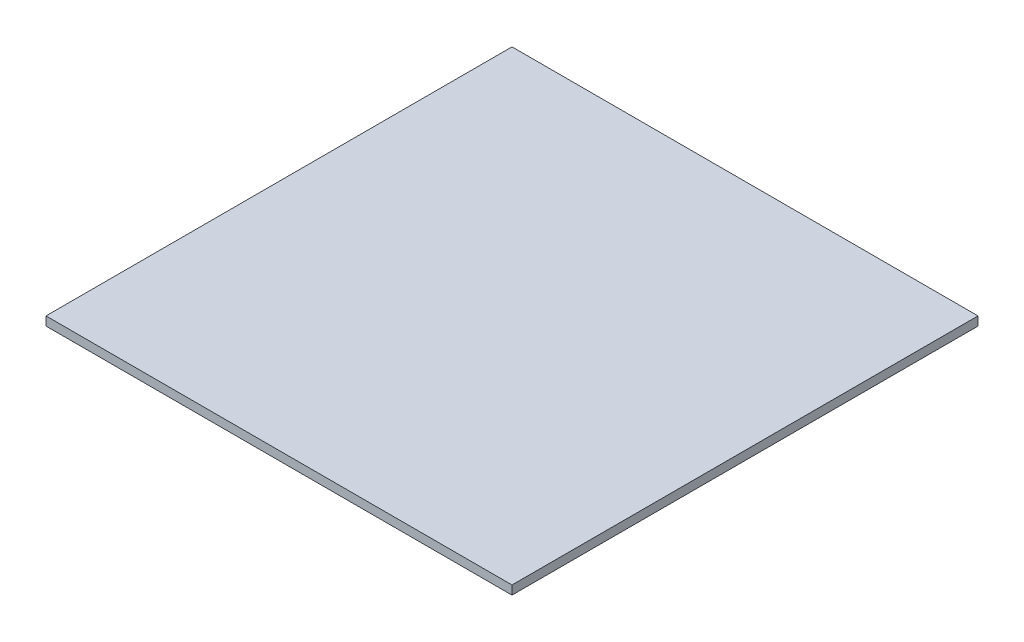
ISO-10303-21;
HEADER;
FILE_DESCRIPTION(('STEP AP214'),'2;1');
FILE_NAME('part.step','',(''),(''),'','','');
FILE_SCHEMA(('AUTOMOTIVE_DESIGN { 1 0 10303 214 1 1 1 1 }'));
ENDSEC;
DATA;
#1=APPLICATION_CONTEXT('core data for automotive mechanical design processes');
#2=APPLICATION_PROTOCOL_DEFINITION('international standard','automotive_design',2000,#1);
#3=PRODUCT_CONTEXT('',#1,'mechanical');
#4=PRODUCT('Part','Part','',(#3));
#5=PRODUCT_RELATED_PRODUCT_CATEGORY('part','',(#4));
#6=PRODUCT_DEFINITION_FORMATION('','',#4);
#7=PRODUCT_DEFINITION_CONTEXT('part definition',#1,'design');
#8=PRODUCT_DEFINITION('design','',#6,#7);
#9=PRODUCT_DEFINITION_SHAPE('','',#8);
#10=(LENGTH_UNIT() NAMED_UNIT(*) SI_UNIT(.MILLI.,.METRE.));
#11=(NAMED_UNIT(*) PLANE_ANGLE_UNIT() SI_UNIT($,.RADIAN.));
#12=(NAMED_UNIT(*) SI_UNIT($,.STERADIAN.) SOLID_ANGLE_UNIT());
#13=UNCERTAINTY_MEASURE_WITH_UNIT(LENGTH_MEASURE(1.E-05),#10,'distance_accuracy_value','');
#14=(GEOMETRIC_REPRESENTATION_CONTEXT(3) GLOBAL_UNCERTAINTY_ASSIGNED_CONTEXT((#13)) GLOBAL_UNIT_ASSIGNED_CONTEXT((#10,
#11,#12)) REPRESENTATION_CONTEXT('',''));
#15=CARTESIAN_POINT('',(0.,0.,0.));
#16=DIRECTION('',(0.,0.,1.));
#17=DIRECTION('',(1.,0.,0.));
#18=AXIS2_PLACEMENT_3D('',#15,#16,#17);
#19=CARTESIAN_POINT('',(0.,1.5875,0.));
#20=DIRECTION('',(-1.,0.,0.));
#21=DIRECTION('',(0.,0.,1.));
#22=AXIS2_PLACEMENT_3D('',#19,#20,#21);
#23=PLANE('',#22);
#24=DIRECTION('',(0.,0.,-1.));
#25=VECTOR('',#24,1.);
#26=CARTESIAN_POINT('',(0.,0.,0.));
#27=LINE('',#26,#25);
#28=CARTESIAN_POINT('',(0.,0.,0.));
#29=VERTEX_POINT('',#28);
#30=CARTESIAN_POINT('',(0.,0.,-108.585));
#31=VERTEX_POINT('',#30);
#32=EDGE_CURVE('E131',#29,#31,#27,.T.);
#33=ORIENTED_EDGE('',*,*,#32,.T.);
#34=DIRECTION('',(0.,-1.,0.));
#35=VECTOR('',#34,1.);
#36=CARTESIAN_POINT('',(0.,1.5875,-108.585));
#37=LINE('',#36,#35);
#38=CARTESIAN_POINT('',(0.,1.5875,-108.585));
#39=VERTEX_POINT('',#38);
#40=EDGE_CURVE('E11',#39,#31,#37,.T.);
#41=ORIENTED_EDGE('',*,*,#40,.F.);
#42=DIRECTION('',(0.,0.,-1.));
#43=VECTOR('',#42,1.);
#44=CARTESIAN_POINT('',(0.,1.5875,0.));
#45=LINE('',#44,#43);
#46=CARTESIAN_POINT('',(0.,1.5875,0.));
#47=VERTEX_POINT('',#46);
#48=EDGE_CURVE('E140',#47,#39,#45,.T.);
#49=ORIENTED_EDGE('',*,*,#48,.F.);
#50=DIRECTION('',(0.,-1.,0.));
#51=VECTOR('',#50,1.);
#52=CARTESIAN_POINT('',(0.,1.5875,0.));
#53=LINE('',#52,#51);
#54=EDGE_CURVE('E149',#47,#29,#53,.T.);
#55=ORIENTED_EDGE('',*,*,#54,.T.);
#56=EDGE_LOOP('',(#33,#41,#49,#55));
#57=FACE_BOUND('',#56,.T.);
#58=ADVANCED_FACE('F33',(#57),#23,.F.);
#59=CARTESIAN_POINT('',(0.,1.5875,-108.585));
#60=DIRECTION('',(0.,0.,1.));
#61=DIRECTION('',(1.,0.,0.));
#62=AXIS2_PLACEMENT_3D('',#59,#60,#61);
#63=PLANE('',#62);
#64=DIRECTION('',(-1.,0.,0.));
#65=VECTOR('',#64,1.);
#66=CARTESIAN_POINT('',(0.,0.,-108.585));
#67=LINE('',#66,#65);
#68=CARTESIAN_POINT('',(-108.585,0.,-108.585));
#69=VERTEX_POINT('',#68);
#70=EDGE_CURVE('E134',#31,#69,#67,.T.);
#71=ORIENTED_EDGE('',*,*,#70,.T.);
#72=DIRECTION('',(0.,-1.,0.));
#73=VECTOR('',#72,1.);
#74=CARTESIAN_POINT('',(-108.585,1.5875,-108.585));
#75=LINE('',#74,#73);
#76=CARTESIAN_POINT('',(-108.585,1.5875,-108.585));
#77=VERTEX_POINT('',#76);
#78=EDGE_CURVE('E41',#77,#69,#75,.T.);
#79=ORIENTED_EDGE('',*,*,#78,.F.);
#80=DIRECTION('',(-1.,0.,0.));
#81=VECTOR('',#80,1.);
#82=CARTESIAN_POINT('',(0.,1.5875,-108.585));
#83=LINE('',#82,#81);
#84=EDGE_CURVE('E75',#39,#77,#83,.T.);
#85=ORIENTED_EDGE('',*,*,#84,.F.);
#86=ORIENTED_EDGE('',*,*,#40,.T.);
#87=EDGE_LOOP('',(#71,#79,#85,#86));
#88=FACE_BOUND('',#87,.T.);
#89=ADVANCED_FACE('F175',(#88),#63,.F.);
#90=CARTESIAN_POINT('',(-108.585,1.5875,0.));
#91=DIRECTION('',(1.,0.,0.));
#92=DIRECTION('',(0.,0.,-1.));
#93=AXIS2_PLACEMENT_3D('',#90,#91,#92);
#94=PLANE('',#93);
#95=DIRECTION('',(0.,0.,1.));
#96=VECTOR('',#95,1.);
#97=CARTESIAN_POINT('',(-108.585,0.,0.));
#98=LINE('',#97,#96);
#99=CARTESIAN_POINT('',(-108.585,0.,0.));
#100=VERTEX_POINT('',#99);
#101=EDGE_CURVE('E65',#69,#100,#98,.T.);
#102=ORIENTED_EDGE('',*,*,#101,.T.);
#103=DIRECTION('',(0.,-1.,0.));
#104=VECTOR('',#103,1.);
#105=CARTESIAN_POINT('',(-108.585,1.5875,0.));
#106=LINE('',#105,#104);
#107=CARTESIAN_POINT('',(-108.585,1.5875,0.));
#108=VERTEX_POINT('',#107);
#109=EDGE_CURVE('E49',#108,#100,#106,.T.);
#110=ORIENTED_EDGE('',*,*,#109,.F.);
#111=DIRECTION('',(0.,0.,1.));
#112=VECTOR('',#111,1.);
#113=CARTESIAN_POINT('',(-108.585,1.5875,0.));
#114=LINE('',#113,#112);
#115=EDGE_CURVE('E144',#77,#108,#114,.T.);
#116=ORIENTED_EDGE('',*,*,#115,.F.);
#117=ORIENTED_EDGE('',*,*,#78,.T.);
#118=EDGE_LOOP('',(#102,#110,#116,#117));
#119=FACE_BOUND('',#118,.T.);
#120=ADVANCED_FACE('F155',(#119),#94,.F.);
#121=CARTESIAN_POINT('',(0.,1.5875,0.));
#122=DIRECTION('',(0.,0.,-1.));
#123=DIRECTION('',(-1.,0.,0.));
#124=AXIS2_PLACEMENT_3D('',#121,#122,#123);
#125=PLANE('',#124);
#126=DIRECTION('',(1.,0.,0.));
#127=VECTOR('',#126,1.);
#128=CARTESIAN_POINT('',(0.,0.,0.));
#129=LINE('',#128,#127);
#130=EDGE_CURVE('E70',#100,#29,#129,.T.);
#131=ORIENTED_EDGE('',*,*,#130,.T.);
#132=ORIENTED_EDGE('',*,*,#54,.F.);
#133=DIRECTION('',(1.,0.,0.));
#134=VECTOR('',#133,1.);
#135=CARTESIAN_POINT('',(0.,1.5875,0.));
#136=LINE('',#135,#134);
#137=EDGE_CURVE('E147',#108,#47,#136,.T.);
#138=ORIENTED_EDGE('',*,*,#137,.F.);
#139=ORIENTED_EDGE('',*,*,#109,.T.);
#140=EDGE_LOOP('',(#131,#132,#138,#139));
#141=FACE_BOUND('',#140,.T.);
#142=ADVANCED_FACE('F160',(#141),#125,.F.);
#143=CARTESIAN_POINT('',(0.,0.,0.));
#144=DIRECTION('',(0.,1.,0.));
#145=DIRECTION('',(0.,0.,1.));
#146=AXIS2_PLACEMENT_3D('',#143,#144,#145);
#147=PLANE('',#146);
#148=ORIENTED_EDGE('',*,*,#32,.F.);
#149=ORIENTED_EDGE('',*,*,#130,.F.);
#150=ORIENTED_EDGE('',*,*,#101,.F.);
#151=ORIENTED_EDGE('',*,*,#70,.F.);
#152=EDGE_LOOP('',(#148,#149,#150,#151));
#153=FACE_BOUND('',#152,.T.);
#154=ADVANCED_FACE('F158',(#153),#147,.F.);
#155=CARTESIAN_POINT('',(0.,1.5875,0.));
#156=DIRECTION('',(0.,1.,0.));
#157=DIRECTION('',(0.,0.,1.));
#158=AXIS2_PLACEMENT_3D('',#155,#156,#157);
#159=PLANE('',#158);
#160=DIRECTION('',(0.,0.,1.));
#161=VECTOR('',#160,1.);
#162=CARTESIAN_POINT('',(-121.285,1.5875,-121.285));
#163=LINE('',#162,#161);
#164=CARTESIAN_POINT('',(-121.285,1.5875,-121.285));
#165=VERTEX_POINT('',#164);
#166=CARTESIAN_POINT('',(-121.285,1.5875,12.7));
#167=VERTEX_POINT('',#166);
#168=EDGE_CURVE('E130',#165,#167,#163,.T.);
#169=ORIENTED_EDGE('',*,*,#168,.F.);
#170=DIRECTION('',(-1.,0.,0.));
#171=VECTOR('',#170,1.);
#172=CARTESIAN_POINT('',(-121.285,1.5875,-121.285));
#173=LINE('',#172,#171);
#174=CARTESIAN_POINT('',(12.7,1.5875,-121.285));
#175=VERTEX_POINT('',#174);
#176=EDGE_CURVE('E126',#175,#165,#173,.T.);
#177=ORIENTED_EDGE('',*,*,#176,.F.);
#178=DIRECTION('',(0.,0.,-1.));
#179=VECTOR('',#178,1.);
#180=CARTESIAN_POINT('',(12.7,1.5875,-121.285));
#181=LINE('',#180,#179);
#182=CARTESIAN_POINT('',(12.7,1.5875,12.7));
#183=VERTEX_POINT('',#182);
#184=EDGE_CURVE('E202',#183,#175,#181,.T.);
#185=ORIENTED_EDGE('',*,*,#184,.F.);
#186=DIRECTION('',(1.,0.,0.));
#187=VECTOR('',#186,1.);
#188=CARTESIAN_POINT('',(-121.285,1.5875,12.7));
#189=LINE('',#188,#187);
#190=EDGE_CURVE('E205',#167,#183,#189,.T.);
#191=ORIENTED_EDGE('',*,*,#190,.F.);
#192=EDGE_LOOP('',(#169,#177,#185,#191));
#193=FACE_BOUND('',#192,.T.);
#194=ORIENTED_EDGE('',*,*,#137,.T.);
#195=ORIENTED_EDGE('',*,*,#48,.T.);
#196=ORIENTED_EDGE('',*,*,#84,.T.);
#197=ORIENTED_EDGE('',*,*,#115,.T.);
#198=EDGE_LOOP('',(#194,#195,#196,#197));
#199=FACE_BOUND('',#198,.T.);
#200=ADVANCED_FACE('F162',(#193,#199),#159,.F.);
#201=CARTESIAN_POINT('',(-121.285,4.1275,-121.285));
#202=DIRECTION('',(1.,0.,0.));
#203=DIRECTION('',(0.,0.,-1.));
#204=AXIS2_PLACEMENT_3D('',#201,#202,#203);
#205=PLANE('',#204);
#206=ORIENTED_EDGE('',*,*,#168,.T.);
#207=DIRECTION('',(0.,-1.,0.));
#208=VECTOR('',#207,1.);
#209=CARTESIAN_POINT('',(-121.285,4.1275,12.7));
#210=LINE('',#209,#208);
#211=CARTESIAN_POINT('',(-121.285,4.1275,12.7));
#212=VERTEX_POINT('',#211);
#213=EDGE_CURVE('E110',#212,#167,#210,.T.);
#214=ORIENTED_EDGE('',*,*,#213,.F.);
#215=DIRECTION('',(0.,0.,1.));
#216=VECTOR('',#215,1.);
#217=CARTESIAN_POINT('',(-121.285,4.1275,-121.285));
#218=LINE('',#217,#216);
#219=CARTESIAN_POINT('',(-121.285,4.1275,-121.285));
#220=VERTEX_POINT('',#219);
#221=EDGE_CURVE('E117',#220,#212,#218,.T.);
#222=ORIENTED_EDGE('',*,*,#221,.F.);
#223=DIRECTION('',(0.,-1.,0.));
#224=VECTOR('',#223,1.);
#225=CARTESIAN_POINT('',(-121.285,4.1275,-121.285));
#226=LINE('',#225,#224);
#227=EDGE_CURVE('E199',#220,#165,#226,.T.);
#228=ORIENTED_EDGE('',*,*,#227,.T.);
#229=EDGE_LOOP('',(#206,#214,#222,#228));
#230=FACE_BOUND('',#229,.T.);
#231=ADVANCED_FACE('F128',(#230),#205,.F.);
#232=CARTESIAN_POINT('',(-121.285,4.1275,12.7));
#233=DIRECTION('',(0.,0.,-1.));
#234=DIRECTION('',(-1.,0.,0.));
#235=AXIS2_PLACEMENT_3D('',#232,#233,#234);
#236=PLANE('',#235);
#237=ORIENTED_EDGE('',*,*,#190,.T.);
#238=DIRECTION('',(0.,-1.,0.));
#239=VECTOR('',#238,1.);
#240=CARTESIAN_POINT('',(12.7,4.1275,12.7));
#241=LINE('',#240,#239);
#242=CARTESIAN_POINT('',(12.7,4.1275,12.7));
#243=VERTEX_POINT('',#242);
#244=EDGE_CURVE('E113',#243,#183,#241,.T.);
#245=ORIENTED_EDGE('',*,*,#244,.F.);
#246=DIRECTION('',(1.,0.,0.));
#247=VECTOR('',#246,1.);
#248=CARTESIAN_POINT('',(-121.285,4.1275,12.7));
#249=LINE('',#248,#247);
#250=EDGE_CURVE('E106',#212,#243,#249,.T.);
#251=ORIENTED_EDGE('',*,*,#250,.F.);
#252=ORIENTED_EDGE('',*,*,#213,.T.);
#253=EDGE_LOOP('',(#237,#245,#251,#252));
#254=FACE_BOUND('',#253,.T.);
#255=ADVANCED_FACE('F108',(#254),#236,.F.);
#256=CARTESIAN_POINT('',(12.7,4.1275,-121.285));
#257=DIRECTION('',(-1.,0.,0.));
#258=DIRECTION('',(0.,0.,1.));
#259=AXIS2_PLACEMENT_3D('',#256,#257,#258);
#260=PLANE('',#259);
#261=ORIENTED_EDGE('',*,*,#184,.T.);
#262=DIRECTION('',(0.,-1.,0.));
#263=VECTOR('',#262,1.);
#264=CARTESIAN_POINT('',(12.7,4.1275,-121.285));
#265=LINE('',#264,#263);
#266=CARTESIAN_POINT('',(12.7,4.1275,-121.285));
#267=VERTEX_POINT('',#266);
#268=EDGE_CURVE('E136',#267,#175,#265,.T.);
#269=ORIENTED_EDGE('',*,*,#268,.F.);
#270=DIRECTION('',(0.,0.,-1.));
#271=VECTOR('',#270,1.);
#272=CARTESIAN_POINT('',(12.7,4.1275,-121.285));
#273=LINE('',#272,#271);
#274=EDGE_CURVE('E116',#243,#267,#273,.T.);
#275=ORIENTED_EDGE('',*,*,#274,.F.);
#276=ORIENTED_EDGE('',*,*,#244,.T.);
#277=EDGE_LOOP('',(#261,#269,#275,#276));
#278=FACE_BOUND('',#277,.T.);
#279=ADVANCED_FACE('F188',(#278),#260,.F.);
#280=CARTESIAN_POINT('',(-121.285,4.1275,-121.285));
#281=DIRECTION('',(0.,0.,1.));
#282=DIRECTION('',(1.,0.,0.));
#283=AXIS2_PLACEMENT_3D('',#280,#281,#282);
#284=PLANE('',#283);
#285=ORIENTED_EDGE('',*,*,#176,.T.);
#286=ORIENTED_EDGE('',*,*,#227,.F.);
#287=DIRECTION('',(-1.,0.,0.));
#288=VECTOR('',#287,1.);
#289=CARTESIAN_POINT('',(-121.285,4.1275,-121.285));
#290=LINE('',#289,#288);
#291=EDGE_CURVE('E122',#267,#220,#290,.T.);
#292=ORIENTED_EDGE('',*,*,#291,.F.);
#293=ORIENTED_EDGE('',*,*,#268,.T.);
#294=EDGE_LOOP('',(#285,#286,#292,#293));
#295=FACE_BOUND('',#294,.T.);
#296=ADVANCED_FACE('F190',(#295),#284,.F.);
#297=CARTESIAN_POINT('',(0.,4.1275,0.));
#298=DIRECTION('',(0.,1.,0.));
#299=DIRECTION('',(0.,0.,1.));
#300=AXIS2_PLACEMENT_3D('',#297,#298,#299);
#301=PLANE('',#300);
#302=ORIENTED_EDGE('',*,*,#221,.T.);
#303=ORIENTED_EDGE('',*,*,#250,.T.);
#304=ORIENTED_EDGE('',*,*,#274,.T.);
#305=ORIENTED_EDGE('',*,*,#291,.T.);
#306=EDGE_LOOP('',(#302,#303,#304,#305));
#307=FACE_BOUND('',#306,.T.);
#308=ADVANCED_FACE('F120',(#307),#301,.T.);
#309=CLOSED_SHELL('',(#58,#89,#120,#142,#154,#200,#231,#255,#279,#296,#308));
#310=MANIFOLD_SOLID_BREP('B2',#309);
#311=ADVANCED_BREP_SHAPE_REPRESENTATION('',(#18,#310),#14);
#312=SHAPE_DEFINITION_REPRESENTATION(#9,#311);
ENDSEC;
END-ISO-10303-21;
